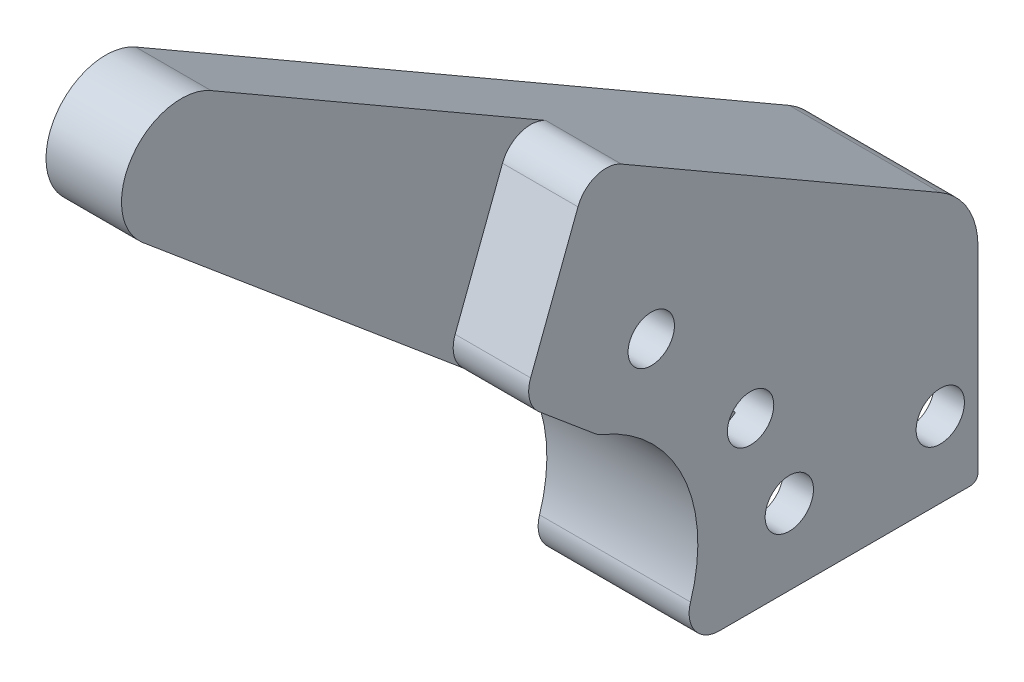
ISO-10303-21;
HEADER;
FILE_DESCRIPTION(('STEP AP214'),'2;1');
FILE_NAME('part.step','',(''),(''),'','','');
FILE_SCHEMA(('AUTOMOTIVE_DESIGN { 1 0 10303 214 1 1 1 1 }'));
ENDSEC;
DATA;
#1=APPLICATION_CONTEXT('core data for automotive mechanical design processes');
#2=APPLICATION_PROTOCOL_DEFINITION('international standard','automotive_design',2000,#1);
#3=PRODUCT_CONTEXT('',#1,'mechanical');
#4=PRODUCT('Part','Part','',(#3));
#5=PRODUCT_RELATED_PRODUCT_CATEGORY('part','',(#4));
#6=PRODUCT_DEFINITION_FORMATION('','',#4);
#7=PRODUCT_DEFINITION_CONTEXT('part definition',#1,'design');
#8=PRODUCT_DEFINITION('design','',#6,#7);
#9=PRODUCT_DEFINITION_SHAPE('','',#8);
#10=(LENGTH_UNIT() NAMED_UNIT(*) SI_UNIT(.MILLI.,.METRE.));
#11=(NAMED_UNIT(*) PLANE_ANGLE_UNIT() SI_UNIT($,.RADIAN.));
#12=(NAMED_UNIT(*) SI_UNIT($,.STERADIAN.) SOLID_ANGLE_UNIT());
#13=UNCERTAINTY_MEASURE_WITH_UNIT(LENGTH_MEASURE(1.E-05),#10,'distance_accuracy_value','');
#14=(GEOMETRIC_REPRESENTATION_CONTEXT(3) GLOBAL_UNCERTAINTY_ASSIGNED_CONTEXT((#13)) GLOBAL_UNIT_ASSIGNED_CONTEXT((#10,
#11,#12)) REPRESENTATION_CONTEXT('',''));
#15=CARTESIAN_POINT('',(0.,0.,0.));
#16=DIRECTION('',(0.,0.,1.));
#17=DIRECTION('',(1.,0.,0.));
#18=AXIS2_PLACEMENT_3D('',#15,#16,#17);
#19=CARTESIAN_POINT('',(2.54,23.8572726280624,-13.774002773942));
#20=DIRECTION('',(0.,-0.86602540378444,0.499999999999998));
#21=DIRECTION('',(0.,-0.499999999999998,-0.86602540378444));
#22=AXIS2_PLACEMENT_3D('',#19,#20,#21);
#23=PLANE('',#22);
#24=DIRECTION('',(0.,0.499999999999998,0.86602540378444));
#25=VECTOR('',#24,1.);
#26=CARTESIAN_POINT('',(-3.81,23.8572726280624,-13.774002773942));
#27=LINE('',#26,#25);
#28=CARTESIAN_POINT('',(-3.81,38.1368933066942,10.9590257542596));
#29=VERTEX_POINT('',#28);
#30=CARTESIAN_POINT('',(-3.81,54.394261314031,39.117613140312));
#31=VERTEX_POINT('',#30);
#32=EDGE_CURVE('E382',#29,#31,#27,.T.);
#33=ORIENTED_EDGE('',*,*,#32,.F.);
#34=DIRECTION('',(1.,0.,0.));
#35=VECTOR('',#34,1.);
#36=CARTESIAN_POINT('',(2.54,38.1368933066942,10.9590257542596));
#37=LINE('',#36,#35);
#38=CARTESIAN_POINT('',(2.54,38.1368933066942,10.9590257542596));
#39=VERTEX_POINT('',#38);
#40=EDGE_CURVE('E278',#29,#39,#37,.T.);
#41=ORIENTED_EDGE('',*,*,#40,.T.);
#42=DIRECTION('',(0.,0.499999999999998,0.86602540378444));
#43=VECTOR('',#42,1.);
#44=CARTESIAN_POINT('',(2.54,23.8572726280624,-13.774002773942));
#45=LINE('',#44,#43);
#46=CARTESIAN_POINT('',(2.54,22.6442613140312,-15.875));
#47=VERTEX_POINT('',#46);
#48=EDGE_CURVE('E231',#47,#39,#45,.T.);
#49=ORIENTED_EDGE('',*,*,#48,.F.);
#50=DIRECTION('',(-1.,0.,0.));
#51=VECTOR('',#50,1.);
#52=CARTESIAN_POINT('',(2.54,22.6442613140312,-15.875));
#53=LINE('',#52,#51);
#54=CARTESIAN_POINT('',(-10.16,22.6442613140312,-15.875));
#55=VERTEX_POINT('',#54);
#56=EDGE_CURVE('E254',#47,#55,#53,.T.);
#57=ORIENTED_EDGE('',*,*,#56,.T.);
#58=DIRECTION('',(0.,-0.499999999999998,-0.86602540378444));
#59=VECTOR('',#58,1.);
#60=CARTESIAN_POINT('',(-10.16,54.3942613140311,39.117613140312));
#61=LINE('',#60,#59);
#62=CARTESIAN_POINT('',(-10.16,54.394261314031,39.117613140312));
#63=VERTEX_POINT('',#62);
#64=EDGE_CURVE('E356',#63,#55,#61,.T.);
#65=ORIENTED_EDGE('',*,*,#64,.F.);
#66=DIRECTION('',(-1.,0.,0.));
#67=VECTOR('',#66,1.);
#68=CARTESIAN_POINT('',(2.54,54.3942613140311,39.117613140312));
#69=LINE('',#68,#67);
#70=EDGE_CURVE('E252',#31,#63,#69,.T.);
#71=ORIENTED_EDGE('',*,*,#70,.F.);
#72=EDGE_LOOP('',(#33,#41,#49,#57,#65,#71));
#73=FACE_BOUND('',#72,.T.);
#74=ADVANCED_FACE('F38',(#73),#23,.F.);
#75=CARTESIAN_POINT('',(2.54,50.0412000371606,41.6308542403118));
#76=DIRECTION('',(-1.,0.,0.));
#77=DIRECTION('',(0.,0.,1.));
#78=AXIS2_PLACEMENT_3D('',#75,#76,#77);
#79=CYLINDRICAL_SURFACE('',#78,5.02648220000002);
#80=DIRECTION('',(-1.,0.,0.));
#81=VECTOR('',#80,1.);
#82=CARTESIAN_POINT('',(2.54,46.1906912794143,44.8618147187819));
#83=LINE('',#82,#81);
#84=CARTESIAN_POINT('',(-3.81,46.1906912794143,44.8618147187819));
#85=VERTEX_POINT('',#84);
#86=CARTESIAN_POINT('',(-10.16,46.1906912794142,44.8618147187819));
#87=VERTEX_POINT('',#86);
#88=EDGE_CURVE('E242',#85,#87,#83,.T.);
#89=ORIENTED_EDGE('',*,*,#88,.F.);
#90=CARTESIAN_POINT('',(-3.81,50.0412000371606,41.6308542403118));
#91=DIRECTION('',(1.,0.,0.));
#92=DIRECTION('',(0.,0.,-1.));
#93=AXIS2_PLACEMENT_3D('',#90,#91,#92);
#94=CIRCLE('',#93,5.02648220000002);
#95=EDGE_CURVE('E380',#31,#85,#94,.T.);
#96=ORIENTED_EDGE('',*,*,#95,.F.);
#97=ORIENTED_EDGE('',*,*,#70,.T.);
#98=CARTESIAN_POINT('',(-10.16,50.0412000371606,41.6308542403118));
#99=DIRECTION('',(-1.,0.,0.));
#100=DIRECTION('',(0.,0.,1.));
#101=AXIS2_PLACEMENT_3D('',#98,#99,#100);
#102=CIRCLE('',#101,5.02648220000006);
#103=EDGE_CURVE('E359',#87,#63,#102,.T.);
#104=ORIENTED_EDGE('',*,*,#103,.F.);
#105=EDGE_LOOP('',(#89,#96,#97,#104));
#106=FACE_BOUND('',#105,.T.);
#107=ADVANCED_FACE('F467',(#106),#79,.T.);
#108=CARTESIAN_POINT('',(2.54,5.01567884800349,-4.20865427146339));
#109=DIRECTION('',(0.,-0.766044443118979,0.642787609686538));
#110=DIRECTION('',(0.,-0.642787609686538,-0.766044443118979));
#111=AXIS2_PLACEMENT_3D('',#108,#109,#110);
#112=PLANE('',#111);
#113=DIRECTION('',(0.,0.642787609686538,0.766044443118979));
#114=VECTOR('',#113,1.);
#115=CARTESIAN_POINT('',(2.54,5.01567884800349,-4.20865427146339));
#116=LINE('',#115,#114);
#117=CARTESIAN_POINT('',(2.54,19.6256972120867,13.2028876018002));
#118=VERTEX_POINT('',#117);
#119=CARTESIAN_POINT('',(2.54,23.521309949758,17.8454980772758));
#120=VERTEX_POINT('',#119);
#121=EDGE_CURVE('E234',#118,#120,#116,.T.);
#122=ORIENTED_EDGE('',*,*,#121,.T.);
#123=DIRECTION('',(1.,0.,0.));
#124=VECTOR('',#123,1.);
#125=CARTESIAN_POINT('',(2.54,23.521309949758,17.8454980772758));
#126=LINE('',#125,#124);
#127=CARTESIAN_POINT('',(-3.81,23.521309949758,17.8454980772758));
#128=VERTEX_POINT('',#127);
#129=EDGE_CURVE('E288',#120,#128,#126,.F.);
#130=ORIENTED_EDGE('',*,*,#129,.T.);
#131=DIRECTION('',(0.,-0.642787609686538,-0.766044443118979));
#132=VECTOR('',#131,1.);
#133=CARTESIAN_POINT('',(-3.81,5.01567884800349,-4.20865427146339));
#134=LINE('',#133,#132);
#135=EDGE_CURVE('E372',#85,#128,#134,.T.);
#136=ORIENTED_EDGE('',*,*,#135,.F.);
#137=ORIENTED_EDGE('',*,*,#88,.T.);
#138=DIRECTION('',(0.,0.642787609686536,0.76604444311898));
#139=VECTOR('',#138,1.);
#140=CARTESIAN_POINT('',(-10.16,19.3612947125966,12.887784973142));
#141=LINE('',#140,#139);
#142=CARTESIAN_POINT('',(-10.16,19.6256972120867,13.2028876018002));
#143=VERTEX_POINT('',#142);
#144=EDGE_CURVE('E343',#143,#87,#141,.T.);
#145=ORIENTED_EDGE('',*,*,#144,.F.);
#146=DIRECTION('',(-1.,0.,0.));
#147=VECTOR('',#146,1.);
#148=CARTESIAN_POINT('',(2.54,19.6256972120867,13.2028876018002));
#149=LINE('',#148,#147);
#150=EDGE_CURVE('E286',#143,#118,#149,.F.);
#151=ORIENTED_EDGE('',*,*,#150,.T.);
#152=EDGE_LOOP('',(#122,#130,#136,#137,#145,#151));
#153=FACE_BOUND('',#152,.T.);
#154=ADVANCED_FACE('F414',(#153),#112,.T.);
#155=CARTESIAN_POINT('',(2.54,0.,0.));
#156=DIRECTION('',(1.,0.,0.));
#157=DIRECTION('',(0.,0.,-1.));
#158=AXIS2_PLACEMENT_3D('',#155,#156,#157);
#159=PLANE('',#158);
#160=CARTESIAN_POINT('',(2.54,24.1395379058303,8.43878050170823));
#161=DIRECTION('',(1.,0.,0.));
#162=DIRECTION('',(0.,0.,-1.));
#163=AXIS2_PLACEMENT_3D('',#160,#161,#162);
#164=CIRCLE('',#163,1.95);
#165=CARTESIAN_POINT('',(2.54,24.1395379058303,6.48878050170823));
#166=VERTEX_POINT('',#165);
#167=EDGE_CURVE('E395',#166,#166,#164,.T.);
#168=ORIENTED_EDGE('',*,*,#167,.F.);
#169=EDGE_LOOP('',(#168));
#170=FACE_BOUND('',#169,.T.);
#171=CARTESIAN_POINT('',(2.54,14.1809601452836,0.0825415757831696));
#172=DIRECTION('',(1.,0.,0.));
#173=DIRECTION('',(0.,0.,-1.));
#174=AXIS2_PLACEMENT_3D('',#171,#172,#173);
#175=CIRCLE('',#174,1.95);
#176=CARTESIAN_POINT('',(2.54,14.1809601452836,-1.86745842421683));
#177=VERTEX_POINT('',#176);
#178=EDGE_CURVE('E389',#177,#177,#175,.T.);
#179=ORIENTED_EDGE('',*,*,#178,.F.);
#180=EDGE_LOOP('',(#179));
#181=FACE_BOUND('',#180,.T.);
#182=CARTESIAN_POINT('',(2.54,6.35,-15.875));
#183=DIRECTION('',(1.,0.,0.));
#184=DIRECTION('',(0.,0.,-1.));
#185=AXIS2_PLACEMENT_3D('',#182,#183,#184);
#186=CIRCLE('',#185,2.032);
#187=CARTESIAN_POINT('',(2.54,6.35,-17.907));
#188=VERTEX_POINT('',#187);
#189=EDGE_CURVE('E237',#188,#188,#186,.T.);
#190=ORIENTED_EDGE('',*,*,#189,.F.);
#191=EDGE_LOOP('',(#190));
#192=FACE_BOUND('',#191,.T.);
#193=CARTESIAN_POINT('',(2.54,6.35,-3.175));
#194=DIRECTION('',(1.,0.,0.));
#195=DIRECTION('',(0.,0.,-1.));
#196=AXIS2_PLACEMENT_3D('',#193,#194,#195);
#197=CIRCLE('',#196,2.032);
#198=CARTESIAN_POINT('',(2.54,6.35,-5.207));
#199=VERTEX_POINT('',#198);
#200=EDGE_CURVE('E240',#199,#199,#197,.T.);
#201=ORIENTED_EDGE('',*,*,#200,.F.);
#202=EDGE_LOOP('',(#201));
#203=FACE_BOUND('',#202,.T.);
#204=DIRECTION('',(0.,0.,-1.));
#205=VECTOR('',#204,1.);
#206=CARTESIAN_POINT('',(2.54,0.,0.));
#207=LINE('',#206,#205);
#208=CARTESIAN_POINT('',(2.54,0.,2.71177962288637));
#209=VERTEX_POINT('',#208);
#210=CARTESIAN_POINT('',(2.54,0.,-18.415));
#211=VERTEX_POINT('',#210);
#212=EDGE_CURVE('E222',#209,#211,#207,.T.);
#213=ORIENTED_EDGE('',*,*,#212,.T.);
#214=CARTESIAN_POINT('',(2.54,0.635000000000007,-18.415));
#215=DIRECTION('',(1.,0.,0.));
#216=DIRECTION('',(0.,0.,-1.));
#217=AXIS2_PLACEMENT_3D('',#214,#215,#216);
#218=CIRCLE('',#217,0.635);
#219=CARTESIAN_POINT('',(2.54,0.635000000000008,-19.05));
#220=VERTEX_POINT('',#219);
#221=EDGE_CURVE('E320',#211,#220,#218,.T.);
#222=ORIENTED_EDGE('',*,*,#221,.T.);
#223=DIRECTION('',(0.,1.,0.));
#224=VECTOR('',#223,1.);
#225=CARTESIAN_POINT('',(2.54,0.,-19.05));
#226=LINE('',#225,#224);
#227=CARTESIAN_POINT('',(2.54,17.145,-19.05));
#228=VERTEX_POINT('',#227);
#229=EDGE_CURVE('E226',#220,#228,#226,.T.);
#230=ORIENTED_EDGE('',*,*,#229,.T.);
#231=CARTESIAN_POINT('',(2.54,17.145,-12.7));
#232=DIRECTION('',(1.,0.,0.));
#233=DIRECTION('',(0.,0.,-1.));
#234=AXIS2_PLACEMENT_3D('',#231,#232,#233);
#235=CIRCLE('',#234,6.35);
#236=EDGE_CURVE('E228',#47,#228,#235,.F.);
#237=ORIENTED_EDGE('',*,*,#236,.F.);
#238=ORIENTED_EDGE('',*,*,#48,.T.);
#239=CARTESIAN_POINT('',(2.54,35.9371887810818,12.2290257542596));
#240=DIRECTION('',(1.,0.,0.));
#241=DIRECTION('',(0.,0.,-1.));
#242=AXIS2_PLACEMENT_3D('',#239,#240,#241);
#243=CIRCLE('',#242,2.54);
#244=CARTESIAN_POINT('',(2.54,36.8404609635108,14.6029885518725));
#245=VERTEX_POINT('',#244);
#246=EDGE_CURVE('E274',#39,#245,#243,.T.);
#247=ORIENTED_EDGE('',*,*,#246,.T.);
#248=DIRECTION('',(0.,-0.934631022682238,0.355618969460227));
#249=VECTOR('',#248,1.);
#250=CARTESIAN_POINT('',(2.54,9.51265554348265,25.0009806634441));
#251=LINE('',#250,#249);
#252=CARTESIAN_POINT('',(2.54,26.3703350177092,18.5867803462849));
#253=VERTEX_POINT('',#252);
#254=EDGE_CURVE('E375',#245,#253,#251,.T.);
#255=ORIENTED_EDGE('',*,*,#254,.T.);
#256=CARTESIAN_POINT('',(2.54,25.4670628352802,16.212817548672));
#257=DIRECTION('',(1.,0.,0.));
#258=DIRECTION('',(0.,0.,-1.));
#259=AXIS2_PLACEMENT_3D('',#256,#257,#258);
#260=CIRCLE('',#259,2.54);
#261=EDGE_CURVE('E272',#253,#120,#260,.T.);
#262=ORIENTED_EDGE('',*,*,#261,.T.);
#263=ORIENTED_EDGE('',*,*,#121,.F.);
#264=CARTESIAN_POINT('',(2.54,21.5714500976089,11.5702070731964));
#265=DIRECTION('',(1.,0.,0.));
#266=DIRECTION('',(0.,0.,-1.));
#267=AXIS2_PLACEMENT_3D('',#264,#265,#266);
#268=CIRCLE('',#267,2.54);
#269=CARTESIAN_POINT('',(2.54,19.2230512375488,12.5379998165399));
#270=VERTEX_POINT('',#269);
#271=EDGE_CURVE('E270',#118,#270,#268,.T.);
#272=ORIENTED_EDGE('',*,*,#271,.T.);
#273=CARTESIAN_POINT('',(2.54,7.24621705124219,17.4737428075918));
#274=DIRECTION('',(1.,0.,0.));
#275=DIRECTION('',(0.,0.,-1.));
#276=AXIS2_PLACEMENT_3D('',#273,#274,#275);
#277=CIRCLE('',#276,12.954);
#278=CARTESIAN_POINT('',(2.54,3.31151099200692,5.13177358759218));
#279=VERTEX_POINT('',#278);
#280=EDGE_CURVE('E219',#279,#270,#277,.T.);
#281=ORIENTED_EDGE('',*,*,#280,.F.);
#282=CARTESIAN_POINT('',(2.54,2.54,2.71177962288637));
#283=DIRECTION('',(1.,0.,0.));
#284=DIRECTION('',(0.,0.,-1.));
#285=AXIS2_PLACEMENT_3D('',#282,#283,#284);
#286=CIRCLE('',#285,2.54);
#287=EDGE_CURVE('E276',#279,#209,#286,.T.);
#288=ORIENTED_EDGE('',*,*,#287,.T.);
#289=EDGE_LOOP('',(#213,#222,#230,#237,#238,#247,#255,#262,#263,#272,#281,#288));
#290=FACE_BOUND('',#289,.T.);
#291=ADVANCED_FACE('F410',(#170,#181,#192,#203,#290),#159,.T.);
#292=CARTESIAN_POINT('',(2.54,7.24621705124219,17.4737428075918));
#293=DIRECTION('',(-1.,0.,0.));
#294=DIRECTION('',(0.,0.,1.));
#295=AXIS2_PLACEMENT_3D('',#292,#293,#294);
#296=CYLINDRICAL_SURFACE('',#295,12.954);
#297=CARTESIAN_POINT('',(-10.16,7.24621705124219,17.4737428075918));
#298=DIRECTION('',(1.,0.,0.));
#299=DIRECTION('',(0.,0.,1.));
#300=AXIS2_PLACEMENT_3D('',#297,#298,#299);
#301=CIRCLE('',#300,12.954);
#302=CARTESIAN_POINT('',(-10.16,3.31151099200692,5.13177358759218));
#303=VERTEX_POINT('',#302);
#304=CARTESIAN_POINT('',(-10.16,19.2230512375488,12.5379998165399));
#305=VERTEX_POINT('',#304);
#306=EDGE_CURVE('E340',#303,#305,#301,.T.);
#307=ORIENTED_EDGE('',*,*,#306,.F.);
#308=DIRECTION('',(-1.,0.,0.));
#309=VECTOR('',#308,1.);
#310=CARTESIAN_POINT('',(2.54,3.31151099200692,5.13177358759218));
#311=LINE('',#310,#309);
#312=EDGE_CURVE('E268',#303,#279,#311,.F.);
#313=ORIENTED_EDGE('',*,*,#312,.T.);
#314=ORIENTED_EDGE('',*,*,#280,.T.);
#315=DIRECTION('',(-1.,0.,0.));
#316=VECTOR('',#315,1.);
#317=CARTESIAN_POINT('',(2.54,19.2230512375488,12.5379998165399));
#318=LINE('',#317,#316);
#319=EDGE_CURVE('E265',#270,#305,#318,.T.);
#320=ORIENTED_EDGE('',*,*,#319,.T.);
#321=EDGE_LOOP('',(#307,#313,#314,#320));
#322=FACE_BOUND('',#321,.T.);
#323=ADVANCED_FACE('F413',(#322),#296,.F.);
#324=CARTESIAN_POINT('',(2.54,0.,0.));
#325=DIRECTION('',(0.,1.,0.));
#326=DIRECTION('',(0.,0.,1.));
#327=AXIS2_PLACEMENT_3D('',#324,#325,#326);
#328=PLANE('',#327);
#329=DIRECTION('',(0.,0.,1.));
#330=VECTOR('',#329,1.);
#331=CARTESIAN_POINT('',(-10.16,0.,-19.05));
#332=LINE('',#331,#330);
#333=CARTESIAN_POINT('',(-10.16,0.,-18.415));
#334=VERTEX_POINT('',#333);
#335=CARTESIAN_POINT('',(-10.16,0.,2.71177962288637));
#336=VERTEX_POINT('',#335);
#337=EDGE_CURVE('E217',#334,#336,#332,.T.);
#338=ORIENTED_EDGE('',*,*,#337,.F.);
#339=DIRECTION('',(1.,0.,0.));
#340=VECTOR('',#339,1.);
#341=CARTESIAN_POINT('',(2.54,0.,-18.415));
#342=LINE('',#341,#340);
#343=CARTESIAN_POINT('',(-7.62,0.,-18.415));
#344=VERTEX_POINT('',#343);
#345=EDGE_CURVE('E311',#334,#344,#342,.T.);
#346=ORIENTED_EDGE('',*,*,#345,.T.);
#347=DIRECTION('',(0.,0.,1.));
#348=VECTOR('',#347,1.);
#349=CARTESIAN_POINT('',(-7.62,0.,-19.05));
#350=LINE('',#349,#348);
#351=CARTESIAN_POINT('',(-7.62,0.,0.635));
#352=VERTEX_POINT('',#351);
#353=EDGE_CURVE('E332',#344,#352,#350,.T.);
#354=ORIENTED_EDGE('',*,*,#353,.T.);
#355=DIRECTION('',(1.,0.,0.));
#356=VECTOR('',#355,1.);
#357=CARTESIAN_POINT('',(0.,0.,0.635));
#358=LINE('',#357,#356);
#359=CARTESIAN_POINT('',(0.,0.,0.635));
#360=VERTEX_POINT('',#359);
#361=EDGE_CURVE('E306',#352,#360,#358,.T.);
#362=ORIENTED_EDGE('',*,*,#361,.T.);
#363=DIRECTION('',(0.,0.,-1.));
#364=VECTOR('',#363,1.);
#365=CARTESIAN_POINT('',(0.,0.,0.));
#366=LINE('',#365,#364);
#367=CARTESIAN_POINT('',(0.,0.,-18.415));
#368=VERTEX_POINT('',#367);
#369=EDGE_CURVE('E206',#360,#368,#366,.T.);
#370=ORIENTED_EDGE('',*,*,#369,.T.);
#371=DIRECTION('',(-1.,0.,0.));
#372=VECTOR('',#371,1.);
#373=CARTESIAN_POINT('',(2.54,0.,-18.415));
#374=LINE('',#373,#372);
#375=EDGE_CURVE('E309',#368,#211,#374,.F.);
#376=ORIENTED_EDGE('',*,*,#375,.T.);
#377=ORIENTED_EDGE('',*,*,#212,.F.);
#378=DIRECTION('',(1.,0.,0.));
#379=VECTOR('',#378,1.);
#380=CARTESIAN_POINT('',(-10.16,0.,2.71177962288637));
#381=LINE('',#380,#379);
#382=EDGE_CURVE('E258',#209,#336,#381,.F.);
#383=ORIENTED_EDGE('',*,*,#382,.T.);
#384=EDGE_LOOP('',(#338,#346,#354,#362,#370,#376,#377,#383));
#385=FACE_BOUND('',#384,.T.);
#386=ADVANCED_FACE('F337',(#385),#328,.F.);
#387=CARTESIAN_POINT('',(2.54,0.,-19.05));
#388=DIRECTION('',(0.,0.,1.));
#389=DIRECTION('',(0.,-1.,0.));
#390=AXIS2_PLACEMENT_3D('',#387,#388,#389);
#391=PLANE('',#390);
#392=DIRECTION('',(0.,1.,0.));
#393=VECTOR('',#392,1.);
#394=CARTESIAN_POINT('',(0.,0.,-19.05));
#395=LINE('',#394,#393);
#396=CARTESIAN_POINT('',(0.,0.635000000000008,-19.05));
#397=VERTEX_POINT('',#396);
#398=CARTESIAN_POINT('',(0.,13.335,-19.05));
#399=VERTEX_POINT('',#398);
#400=EDGE_CURVE('E210',#397,#399,#395,.T.);
#401=ORIENTED_EDGE('',*,*,#400,.T.);
#402=DIRECTION('',(1.,0.,0.));
#403=VECTOR('',#402,1.);
#404=CARTESIAN_POINT('',(-7.62,13.335,-19.05));
#405=LINE('',#404,#403);
#406=CARTESIAN_POINT('',(-7.62,13.335,-19.05));
#407=VERTEX_POINT('',#406);
#408=EDGE_CURVE('E303',#399,#407,#405,.F.);
#409=ORIENTED_EDGE('',*,*,#408,.T.);
#410=DIRECTION('',(0.,-1.,0.));
#411=VECTOR('',#410,1.);
#412=CARTESIAN_POINT('',(-7.62,17.145,-19.05));
#413=LINE('',#412,#411);
#414=CARTESIAN_POINT('',(-7.62,0.635000000000007,-19.05));
#415=VERTEX_POINT('',#414);
#416=EDGE_CURVE('E341',#407,#415,#413,.T.);
#417=ORIENTED_EDGE('',*,*,#416,.T.);
#418=DIRECTION('',(1.,0.,0.));
#419=VECTOR('',#418,1.);
#420=CARTESIAN_POINT('',(2.54,0.635000000000008,-19.05));
#421=LINE('',#420,#419);
#422=CARTESIAN_POINT('',(-10.16,0.635000000000007,-19.05));
#423=VERTEX_POINT('',#422);
#424=EDGE_CURVE('E301',#415,#423,#421,.F.);
#425=ORIENTED_EDGE('',*,*,#424,.T.);
#426=DIRECTION('',(0.,-1.,0.));
#427=VECTOR('',#426,1.);
#428=CARTESIAN_POINT('',(-10.16,17.145,-19.05));
#429=LINE('',#428,#427);
#430=CARTESIAN_POINT('',(-10.16,17.145,-19.05));
#431=VERTEX_POINT('',#430);
#432=EDGE_CURVE('E350',#431,#423,#429,.T.);
#433=ORIENTED_EDGE('',*,*,#432,.F.);
#434=DIRECTION('',(-1.,0.,0.));
#435=VECTOR('',#434,1.);
#436=CARTESIAN_POINT('',(2.54,17.145,-19.05));
#437=LINE('',#436,#435);
#438=EDGE_CURVE('E256',#228,#431,#437,.T.);
#439=ORIENTED_EDGE('',*,*,#438,.F.);
#440=ORIENTED_EDGE('',*,*,#229,.F.);
#441=DIRECTION('',(-1.,0.,0.));
#442=VECTOR('',#441,1.);
#443=CARTESIAN_POINT('',(2.54,0.635000000000008,-19.05));
#444=LINE('',#443,#442);
#445=EDGE_CURVE('E298',#220,#397,#444,.T.);
#446=ORIENTED_EDGE('',*,*,#445,.T.);
#447=EDGE_LOOP('',(#401,#409,#417,#425,#433,#439,#440,#446));
#448=FACE_BOUND('',#447,.T.);
#449=ADVANCED_FACE('F433',(#448),#391,.F.);
#450=CARTESIAN_POINT('',(2.54,17.145,-12.7));
#451=DIRECTION('',(-1.,0.,0.));
#452=DIRECTION('',(0.,0.,1.));
#453=AXIS2_PLACEMENT_3D('',#450,#451,#452);
#454=CYLINDRICAL_SURFACE('',#453,6.35);
#455=ORIENTED_EDGE('',*,*,#438,.T.);
#456=CARTESIAN_POINT('',(-10.16,17.145,-12.7));
#457=DIRECTION('',(-1.,0.,0.));
#458=DIRECTION('',(0.,0.,1.));
#459=AXIS2_PLACEMENT_3D('',#456,#457,#458);
#460=CIRCLE('',#459,6.34999999999999);
#461=EDGE_CURVE('E353',#55,#431,#460,.T.);
#462=ORIENTED_EDGE('',*,*,#461,.F.);
#463=ORIENTED_EDGE('',*,*,#56,.F.);
#464=ORIENTED_EDGE('',*,*,#236,.T.);
#465=EDGE_LOOP('',(#455,#462,#463,#464));
#466=FACE_BOUND('',#465,.T.);
#467=ADVANCED_FACE('F475',(#466),#454,.T.);
#468=CARTESIAN_POINT('',(2.54,6.35,-15.875));
#469=DIRECTION('',(-1.,0.,0.));
#470=DIRECTION('',(0.,0.,1.));
#471=AXIS2_PLACEMENT_3D('',#468,#469,#470);
#472=CYLINDRICAL_SURFACE('',#471,2.032);
#473=ORIENTED_EDGE('',*,*,#189,.T.);
#474=EDGE_LOOP('',(#473));
#475=FACE_BOUND('',#474,.T.);
#476=CARTESIAN_POINT('',(0.,6.35,-15.875));
#477=DIRECTION('',(1.,0.,0.));
#478=DIRECTION('',(0.,0.,-1.));
#479=AXIS2_PLACEMENT_3D('',#476,#477,#478);
#480=CIRCLE('',#479,2.032);
#481=CARTESIAN_POINT('',(0.,6.35,-17.907));
#482=VERTEX_POINT('',#481);
#483=EDGE_CURVE('E245',#482,#482,#480,.T.);
#484=ORIENTED_EDGE('',*,*,#483,.F.);
#485=EDGE_LOOP('',(#484));
#486=FACE_BOUND('',#485,.T.);
#487=ADVANCED_FACE('F510',(#475,#486),#472,.F.);
#488=CARTESIAN_POINT('',(2.54,6.35,-3.175));
#489=DIRECTION('',(-1.,0.,0.));
#490=DIRECTION('',(0.,0.,1.));
#491=AXIS2_PLACEMENT_3D('',#488,#489,#490);
#492=CYLINDRICAL_SURFACE('',#491,2.032);
#493=ORIENTED_EDGE('',*,*,#200,.T.);
#494=EDGE_LOOP('',(#493));
#495=FACE_BOUND('',#494,.T.);
#496=CARTESIAN_POINT('',(0.,6.35,-3.175));
#497=DIRECTION('',(1.,0.,0.));
#498=DIRECTION('',(0.,0.,-1.));
#499=AXIS2_PLACEMENT_3D('',#496,#497,#498);
#500=CIRCLE('',#499,2.032);
#501=CARTESIAN_POINT('',(0.,6.35,-5.207));
#502=VERTEX_POINT('',#501);
#503=EDGE_CURVE('E223',#502,#502,#500,.T.);
#504=ORIENTED_EDGE('',*,*,#503,.F.);
#505=EDGE_LOOP('',(#504));
#506=FACE_BOUND('',#505,.T.);
#507=ADVANCED_FACE('F548',(#495,#506),#492,.F.);
#508=CARTESIAN_POINT('',(0.,0.,0.));
#509=DIRECTION('',(1.,0.,0.));
#510=DIRECTION('',(0.,0.,-1.));
#511=AXIS2_PLACEMENT_3D('',#508,#509,#510);
#512=PLANE('',#511);
#513=DIRECTION('',(0.,1.,0.));
#514=VECTOR('',#513,1.);
#515=CARTESIAN_POINT('',(0.,0.,0.));
#516=LINE('',#515,#514);
#517=CARTESIAN_POINT('',(0.,0.635,0.));
#518=VERTEX_POINT('',#517);
#519=CARTESIAN_POINT('',(0.,12.232707880235,0.));
#520=VERTEX_POINT('',#519);
#521=EDGE_CURVE('E215',#518,#520,#516,.T.);
#522=ORIENTED_EDGE('',*,*,#521,.T.);
#523=CARTESIAN_POINT('',(0.,14.1809601452836,0.0825415757831696));
#524=DIRECTION('',(1.,0.,0.));
#525=DIRECTION('',(0.,0.,-1.));
#526=AXIS2_PLACEMENT_3D('',#523,#524,#525);
#527=CIRCLE('',#526,1.95);
#528=CARTESIAN_POINT('',(0.,12.7,-1.18602338041006));
#529=VERTEX_POINT('',#528);
#530=EDGE_CURVE('E199',#520,#529,#527,.T.);
#531=ORIENTED_EDGE('',*,*,#530,.T.);
#532=DIRECTION('',(0.,0.,-1.));
#533=VECTOR('',#532,1.);
#534=CARTESIAN_POINT('',(0.,12.7,0.));
#535=LINE('',#534,#533);
#536=CARTESIAN_POINT('',(0.,12.7,-18.415));
#537=VERTEX_POINT('',#536);
#538=EDGE_CURVE('E198',#529,#537,#535,.T.);
#539=ORIENTED_EDGE('',*,*,#538,.T.);
#540=CARTESIAN_POINT('',(0.,13.335,-18.415));
#541=DIRECTION('',(1.,0.,0.));
#542=DIRECTION('',(0.,0.,-1.));
#543=AXIS2_PLACEMENT_3D('',#540,#541,#542);
#544=CIRCLE('',#543,0.635);
#545=EDGE_CURVE('E324',#537,#399,#544,.T.);
#546=ORIENTED_EDGE('',*,*,#545,.T.);
#547=ORIENTED_EDGE('',*,*,#400,.F.);
#548=CARTESIAN_POINT('',(0.,0.635000000000007,-18.415));
#549=DIRECTION('',(1.,0.,0.));
#550=DIRECTION('',(0.,0.,-1.));
#551=AXIS2_PLACEMENT_3D('',#548,#549,#550);
#552=CIRCLE('',#551,0.635);
#553=EDGE_CURVE('E318',#397,#368,#552,.F.);
#554=ORIENTED_EDGE('',*,*,#553,.T.);
#555=ORIENTED_EDGE('',*,*,#369,.F.);
#556=CARTESIAN_POINT('',(0.,0.635,0.635));
#557=DIRECTION('',(1.,0.,0.));
#558=DIRECTION('',(0.,0.,-1.));
#559=AXIS2_PLACEMENT_3D('',#556,#557,#558);
#560=CIRCLE('',#559,0.635);
#561=EDGE_CURVE('E60',#360,#518,#560,.T.);
#562=ORIENTED_EDGE('',*,*,#561,.T.);
#563=EDGE_LOOP('',(#522,#531,#539,#546,#547,#554,#555,#562));
#564=FACE_BOUND('',#563,.T.);
#565=ORIENTED_EDGE('',*,*,#483,.T.);
#566=EDGE_LOOP('',(#565));
#567=FACE_BOUND('',#566,.T.);
#568=ORIENTED_EDGE('',*,*,#503,.T.);
#569=EDGE_LOOP('',(#568));
#570=FACE_BOUND('',#569,.T.);
#571=ADVANCED_FACE('F435',(#564,#567,#570),#512,.F.);
#572=CARTESIAN_POINT('',(-7.62,12.7,0.));
#573=DIRECTION('',(0.,-1.,0.));
#574=DIRECTION('',(0.,0.,-1.));
#575=AXIS2_PLACEMENT_3D('',#572,#573,#574);
#576=PLANE('',#575);
#577=DIRECTION('',(1.,0.,0.));
#578=VECTOR('',#577,1.);
#579=CARTESIAN_POINT('',(-10.16,12.7,-1.18602338041006));
#580=LINE('',#579,#578);
#581=CARTESIAN_POINT('',(-7.62,12.7,-1.18602338041006));
#582=VERTEX_POINT('',#581);
#583=EDGE_CURVE('E186',#582,#529,#580,.T.);
#584=ORIENTED_EDGE('',*,*,#583,.F.);
#585=DIRECTION('',(0.,0.,-1.));
#586=VECTOR('',#585,1.);
#587=CARTESIAN_POINT('',(-7.62,12.7,0.));
#588=LINE('',#587,#586);
#589=CARTESIAN_POINT('',(-7.62,12.7,-18.415));
#590=VERTEX_POINT('',#589);
#591=EDGE_CURVE('E196',#582,#590,#588,.T.);
#592=ORIENTED_EDGE('',*,*,#591,.T.);
#593=DIRECTION('',(1.,0.,0.));
#594=VECTOR('',#593,1.);
#595=CARTESIAN_POINT('',(0.,12.7,-18.415));
#596=LINE('',#595,#594);
#597=EDGE_CURVE('E296',#590,#537,#596,.T.);
#598=ORIENTED_EDGE('',*,*,#597,.T.);
#599=ORIENTED_EDGE('',*,*,#538,.F.);
#600=EDGE_LOOP('',(#584,#592,#598,#599));
#601=FACE_BOUND('',#600,.T.);
#602=ADVANCED_FACE('F194',(#601),#576,.T.);
#603=CARTESIAN_POINT('',(-7.62,0.,0.));
#604=DIRECTION('',(0.,0.,-1.));
#605=DIRECTION('',(0.,1.,0.));
#606=AXIS2_PLACEMENT_3D('',#603,#604,#605);
#607=PLANE('',#606);
#608=DIRECTION('',(1.,0.,0.));
#609=VECTOR('',#608,1.);
#610=CARTESIAN_POINT('',(-10.16,12.232707880235,0.));
#611=LINE('',#610,#609);
#612=CARTESIAN_POINT('',(-7.62,12.232707880235,0.));
#613=VERTEX_POINT('',#612);
#614=EDGE_CURVE('E53',#520,#613,#611,.F.);
#615=ORIENTED_EDGE('',*,*,#614,.F.);
#616=ORIENTED_EDGE('',*,*,#521,.F.);
#617=DIRECTION('',(1.,0.,0.));
#618=VECTOR('',#617,1.);
#619=CARTESIAN_POINT('',(-7.62,0.635,0.));
#620=LINE('',#619,#618);
#621=CARTESIAN_POINT('',(-7.62,0.635,0.));
#622=VERTEX_POINT('',#621);
#623=EDGE_CURVE('E322',#518,#622,#620,.F.);
#624=ORIENTED_EDGE('',*,*,#623,.T.);
#625=DIRECTION('',(0.,1.,0.));
#626=VECTOR('',#625,1.);
#627=CARTESIAN_POINT('',(-7.62,0.,0.));
#628=LINE('',#627,#626);
#629=EDGE_CURVE('E207',#622,#613,#628,.T.);
#630=ORIENTED_EDGE('',*,*,#629,.T.);
#631=EDGE_LOOP('',(#615,#616,#624,#630));
#632=FACE_BOUND('',#631,.T.);
#633=ADVANCED_FACE('F538',(#632),#607,.T.);
#634=CARTESIAN_POINT('',(-10.16,7.24621705124219,17.4737428075918));
#635=DIRECTION('',(-1.,0.,0.));
#636=DIRECTION('',(0.,0.,1.));
#637=AXIS2_PLACEMENT_3D('',#634,#635,#636);
#638=PLANE('',#637);
#639=CARTESIAN_POINT('',(-10.16,24.1395379058303,8.43878050170823));
#640=DIRECTION('',(1.,0.,0.));
#641=DIRECTION('',(0.,0.,-1.));
#642=AXIS2_PLACEMENT_3D('',#639,#640,#641);
#643=CIRCLE('',#642,1.95);
#644=CARTESIAN_POINT('',(-10.16,24.1395379058303,6.48878050170823));
#645=VERTEX_POINT('',#644);
#646=EDGE_CURVE('E388',#645,#645,#643,.T.);
#647=ORIENTED_EDGE('',*,*,#646,.T.);
#648=EDGE_LOOP('',(#647));
#649=FACE_BOUND('',#648,.T.);
#650=CARTESIAN_POINT('',(-10.16,14.1809601452836,0.0825415757831696));
#651=DIRECTION('',(1.,0.,0.));
#652=DIRECTION('',(0.,0.,-1.));
#653=AXIS2_PLACEMENT_3D('',#650,#651,#652);
#654=CIRCLE('',#653,1.95);
#655=CARTESIAN_POINT('',(-10.16,14.1809601452836,-1.86745842421683));
#656=VERTEX_POINT('',#655);
#657=EDGE_CURVE('E392',#656,#656,#654,.T.);
#658=ORIENTED_EDGE('',*,*,#657,.T.);
#659=EDGE_LOOP('',(#658));
#660=FACE_BOUND('',#659,.T.);
#661=CARTESIAN_POINT('',(-10.16,6.35,-3.175));
#662=DIRECTION('',(-1.,0.,0.));
#663=DIRECTION('',(0.,0.,1.));
#664=AXIS2_PLACEMENT_3D('',#661,#662,#663);
#665=CIRCLE('',#664,2.032);
#666=CARTESIAN_POINT('',(-10.16,6.35,-1.14300000000001));
#667=VERTEX_POINT('',#666);
#668=EDGE_CURVE('E346',#667,#667,#665,.T.);
#669=ORIENTED_EDGE('',*,*,#668,.F.);
#670=EDGE_LOOP('',(#669));
#671=FACE_BOUND('',#670,.T.);
#672=ORIENTED_EDGE('',*,*,#432,.T.);
#673=CARTESIAN_POINT('',(-10.16,0.635000000000007,-18.415));
#674=DIRECTION('',(-1.,0.,0.));
#675=DIRECTION('',(0.,0.,1.));
#676=AXIS2_PLACEMENT_3D('',#673,#674,#675);
#677=CIRCLE('',#676,0.635);
#678=EDGE_CURVE('E316',#423,#334,#677,.T.);
#679=ORIENTED_EDGE('',*,*,#678,.T.);
#680=ORIENTED_EDGE('',*,*,#337,.T.);
#681=CARTESIAN_POINT('',(-10.16,2.54,2.71177962288637));
#682=DIRECTION('',(-1.,0.,0.));
#683=DIRECTION('',(0.,0.,1.));
#684=AXIS2_PLACEMENT_3D('',#681,#682,#683);
#685=CIRCLE('',#684,2.54);
#686=EDGE_CURVE('E263',#336,#303,#685,.T.);
#687=ORIENTED_EDGE('',*,*,#686,.T.);
#688=ORIENTED_EDGE('',*,*,#306,.T.);
#689=CARTESIAN_POINT('',(-10.16,21.5714500976089,11.5702070731964));
#690=DIRECTION('',(-1.,0.,0.));
#691=DIRECTION('',(0.,0.,1.));
#692=AXIS2_PLACEMENT_3D('',#689,#690,#691);
#693=CIRCLE('',#692,2.54);
#694=EDGE_CURVE('E261',#305,#143,#693,.T.);
#695=ORIENTED_EDGE('',*,*,#694,.T.);
#696=ORIENTED_EDGE('',*,*,#144,.T.);
#697=ORIENTED_EDGE('',*,*,#103,.T.);
#698=ORIENTED_EDGE('',*,*,#64,.T.);
#699=ORIENTED_EDGE('',*,*,#461,.T.);
#700=EDGE_LOOP('',(#672,#679,#680,#687,#688,#695,#696,#697,#698,#699));
#701=FACE_BOUND('',#700,.T.);
#702=CARTESIAN_POINT('',(-10.16,6.35,-15.875));
#703=DIRECTION('',(-1.,0.,0.));
#704=DIRECTION('',(0.,0.,1.));
#705=AXIS2_PLACEMENT_3D('',#702,#703,#704);
#706=CIRCLE('',#705,2.032);
#707=CARTESIAN_POINT('',(-10.16,6.35,-13.843));
#708=VERTEX_POINT('',#707);
#709=EDGE_CURVE('E366',#708,#708,#706,.T.);
#710=ORIENTED_EDGE('',*,*,#709,.F.);
#711=EDGE_LOOP('',(#710));
#712=FACE_BOUND('',#711,.T.);
#713=ADVANCED_FACE('F401',(#649,#660,#671,#701,#712),#638,.T.);
#714=CARTESIAN_POINT('',(-7.62,7.24621705124219,17.4737428075918));
#715=DIRECTION('',(-1.,0.,0.));
#716=DIRECTION('',(0.,0.,1.));
#717=AXIS2_PLACEMENT_3D('',#714,#715,#716);
#718=PLANE('',#717);
#719=ORIENTED_EDGE('',*,*,#591,.F.);
#720=CARTESIAN_POINT('',(-7.62,14.1809601452836,0.0825415757831696));
#721=DIRECTION('',(-1.,0.,0.));
#722=DIRECTION('',(0.,0.,1.));
#723=AXIS2_PLACEMENT_3D('',#720,#721,#722);
#724=CIRCLE('',#723,1.95);
#725=EDGE_CURVE('E11',#582,#613,#724,.T.);
#726=ORIENTED_EDGE('',*,*,#725,.T.);
#727=ORIENTED_EDGE('',*,*,#629,.F.);
#728=CARTESIAN_POINT('',(-7.62,0.635,0.635));
#729=DIRECTION('',(-1.,0.,0.));
#730=DIRECTION('',(0.,0.,1.));
#731=AXIS2_PLACEMENT_3D('',#728,#729,#730);
#732=CIRCLE('',#731,0.635);
#733=EDGE_CURVE('E46',#622,#352,#732,.T.);
#734=ORIENTED_EDGE('',*,*,#733,.T.);
#735=ORIENTED_EDGE('',*,*,#353,.F.);
#736=CARTESIAN_POINT('',(-7.62,0.635000000000007,-18.415));
#737=DIRECTION('',(-1.,0.,0.));
#738=DIRECTION('',(0.,0.,1.));
#739=AXIS2_PLACEMENT_3D('',#736,#737,#738);
#740=CIRCLE('',#739,0.635);
#741=EDGE_CURVE('E314',#344,#415,#740,.F.);
#742=ORIENTED_EDGE('',*,*,#741,.T.);
#743=ORIENTED_EDGE('',*,*,#416,.F.);
#744=CARTESIAN_POINT('',(-7.62,13.335,-18.415));
#745=DIRECTION('',(-1.,0.,0.));
#746=DIRECTION('',(0.,0.,1.));
#747=AXIS2_PLACEMENT_3D('',#744,#745,#746);
#748=CIRCLE('',#747,0.635);
#749=EDGE_CURVE('E204',#407,#590,#748,.T.);
#750=ORIENTED_EDGE('',*,*,#749,.T.);
#751=EDGE_LOOP('',(#719,#726,#727,#734,#735,#742,#743,#750));
#752=FACE_BOUND('',#751,.T.);
#753=CARTESIAN_POINT('',(-7.62,6.35,-3.175));
#754=DIRECTION('',(-1.,0.,0.));
#755=DIRECTION('',(0.,0.,1.));
#756=AXIS2_PLACEMENT_3D('',#753,#754,#755);
#757=CIRCLE('',#756,2.032);
#758=CARTESIAN_POINT('',(-7.62,6.35,-1.14300000000001));
#759=VERTEX_POINT('',#758);
#760=EDGE_CURVE('E363',#759,#759,#757,.T.);
#761=ORIENTED_EDGE('',*,*,#760,.T.);
#762=EDGE_LOOP('',(#761));
#763=FACE_BOUND('',#762,.T.);
#764=CARTESIAN_POINT('',(-7.62,6.35,-15.875));
#765=DIRECTION('',(-1.,0.,0.));
#766=DIRECTION('',(0.,0.,1.));
#767=AXIS2_PLACEMENT_3D('',#764,#765,#766);
#768=CIRCLE('',#767,2.032);
#769=CARTESIAN_POINT('',(-7.62,6.35,-13.843));
#770=VERTEX_POINT('',#769);
#771=EDGE_CURVE('E369',#770,#770,#768,.T.);
#772=ORIENTED_EDGE('',*,*,#771,.T.);
#773=EDGE_LOOP('',(#772));
#774=FACE_BOUND('',#773,.T.);
#775=ADVANCED_FACE('F201',(#752,#763,#774),#718,.F.);
#776=CARTESIAN_POINT('',(-10.16,6.35,-3.175));
#777=DIRECTION('',(1.,0.,0.));
#778=DIRECTION('',(0.,0.,-1.));
#779=AXIS2_PLACEMENT_3D('',#776,#777,#778);
#780=CYLINDRICAL_SURFACE('',#779,2.032);
#781=ORIENTED_EDGE('',*,*,#668,.T.);
#782=EDGE_LOOP('',(#781));
#783=FACE_BOUND('',#782,.T.);
#784=ORIENTED_EDGE('',*,*,#760,.F.);
#785=EDGE_LOOP('',(#784));
#786=FACE_BOUND('',#785,.T.);
#787=ADVANCED_FACE('F531',(#783,#786),#780,.F.);
#788=CARTESIAN_POINT('',(-10.16,6.35,-15.875));
#789=DIRECTION('',(1.,0.,0.));
#790=DIRECTION('',(0.,0.,-1.));
#791=AXIS2_PLACEMENT_3D('',#788,#789,#790);
#792=CYLINDRICAL_SURFACE('',#791,2.032);
#793=ORIENTED_EDGE('',*,*,#709,.T.);
#794=EDGE_LOOP('',(#793));
#795=FACE_BOUND('',#794,.T.);
#796=ORIENTED_EDGE('',*,*,#771,.F.);
#797=EDGE_LOOP('',(#796));
#798=FACE_BOUND('',#797,.T.);
#799=ADVANCED_FACE('F525',(#795,#798),#792,.F.);
#800=CARTESIAN_POINT('',(-3.81,9.51265554348265,25.0009806634441));
#801=DIRECTION('',(0.,0.355618969460227,0.934631022682238));
#802=DIRECTION('',(0.,-0.934631022682238,0.355618969460227));
#803=AXIS2_PLACEMENT_3D('',#800,#801,#802);
#804=PLANE('',#803);
#805=ORIENTED_EDGE('',*,*,#254,.F.);
#806=DIRECTION('',(1.,0.,0.));
#807=VECTOR('',#806,1.);
#808=CARTESIAN_POINT('',(-3.81,36.8404609635107,14.6029885518725));
#809=LINE('',#808,#807);
#810=CARTESIAN_POINT('',(-3.81,36.8404609635108,14.6029885518725));
#811=VERTEX_POINT('',#810);
#812=EDGE_CURVE('E284',#245,#811,#809,.F.);
#813=ORIENTED_EDGE('',*,*,#812,.T.);
#814=DIRECTION('',(0.,-0.934631022682238,0.355618969460227));
#815=VECTOR('',#814,1.);
#816=CARTESIAN_POINT('',(-3.81,9.51265554348265,25.0009806634441));
#817=LINE('',#816,#815);
#818=CARTESIAN_POINT('',(-3.81,26.3703350177092,18.5867803462849));
#819=VERTEX_POINT('',#818);
#820=EDGE_CURVE('E378',#811,#819,#817,.T.);
#821=ORIENTED_EDGE('',*,*,#820,.T.);
#822=DIRECTION('',(1.,0.,0.));
#823=VECTOR('',#822,1.);
#824=CARTESIAN_POINT('',(-3.81,26.3703350177092,18.5867803462849));
#825=LINE('',#824,#823);
#826=EDGE_CURVE('E281',#819,#253,#825,.T.);
#827=ORIENTED_EDGE('',*,*,#826,.T.);
#828=EDGE_LOOP('',(#805,#813,#821,#827));
#829=FACE_BOUND('',#828,.T.);
#830=ADVANCED_FACE('F481',(#829),#804,.T.);
#831=CARTESIAN_POINT('',(-3.81,0.,0.));
#832=DIRECTION('',(1.,0.,0.));
#833=DIRECTION('',(0.,0.,-1.));
#834=AXIS2_PLACEMENT_3D('',#831,#832,#833);
#835=PLANE('',#834);
#836=ORIENTED_EDGE('',*,*,#820,.F.);
#837=CARTESIAN_POINT('',(-3.81,35.9371887810818,12.2290257542596));
#838=DIRECTION('',(1.,0.,0.));
#839=DIRECTION('',(0.,0.,-1.));
#840=AXIS2_PLACEMENT_3D('',#837,#838,#839);
#841=CIRCLE('',#840,2.54);
#842=EDGE_CURVE('E291',#811,#29,#841,.F.);
#843=ORIENTED_EDGE('',*,*,#842,.T.);
#844=ORIENTED_EDGE('',*,*,#32,.T.);
#845=ORIENTED_EDGE('',*,*,#95,.T.);
#846=ORIENTED_EDGE('',*,*,#135,.T.);
#847=CARTESIAN_POINT('',(-3.81,25.4670628352802,16.212817548672));
#848=DIRECTION('',(1.,0.,0.));
#849=DIRECTION('',(0.,0.,-1.));
#850=AXIS2_PLACEMENT_3D('',#847,#848,#849);
#851=CIRCLE('',#850,2.54);
#852=EDGE_CURVE('E294',#128,#819,#851,.F.);
#853=ORIENTED_EDGE('',*,*,#852,.T.);
#854=EDGE_LOOP('',(#836,#843,#844,#845,#846,#853));
#855=FACE_BOUND('',#854,.T.);
#856=ADVANCED_FACE('F487',(#855),#835,.T.);
#857=CARTESIAN_POINT('',(2.54,2.54,2.71177962288637));
#858=DIRECTION('',(-1.,0.,0.));
#859=DIRECTION('',(0.,0.,1.));
#860=AXIS2_PLACEMENT_3D('',#857,#858,#859);
#861=CYLINDRICAL_SURFACE('',#860,2.54);
#862=ORIENTED_EDGE('',*,*,#287,.F.);
#863=ORIENTED_EDGE('',*,*,#312,.F.);
#864=ORIENTED_EDGE('',*,*,#686,.F.);
#865=ORIENTED_EDGE('',*,*,#382,.F.);
#866=EDGE_LOOP('',(#862,#863,#864,#865));
#867=FACE_BOUND('',#866,.T.);
#868=ADVANCED_FACE('F450',(#867),#861,.T.);
#869=CARTESIAN_POINT('',(2.54,35.9371887810818,12.2290257542596));
#870=DIRECTION('',(-1.,0.,0.));
#871=DIRECTION('',(0.,0.,1.));
#872=AXIS2_PLACEMENT_3D('',#869,#870,#871);
#873=CYLINDRICAL_SURFACE('',#872,2.54);
#874=ORIENTED_EDGE('',*,*,#842,.F.);
#875=ORIENTED_EDGE('',*,*,#812,.F.);
#876=ORIENTED_EDGE('',*,*,#246,.F.);
#877=ORIENTED_EDGE('',*,*,#40,.F.);
#878=EDGE_LOOP('',(#874,#875,#876,#877));
#879=FACE_BOUND('',#878,.T.);
#880=ADVANCED_FACE('F485',(#879),#873,.T.);
#881=CARTESIAN_POINT('',(-3.81,25.4670628352802,16.212817548672));
#882=DIRECTION('',(1.,0.,0.));
#883=DIRECTION('',(0.,0.,-1.));
#884=AXIS2_PLACEMENT_3D('',#881,#882,#883);
#885=CYLINDRICAL_SURFACE('',#884,2.54);
#886=ORIENTED_EDGE('',*,*,#852,.F.);
#887=ORIENTED_EDGE('',*,*,#129,.F.);
#888=ORIENTED_EDGE('',*,*,#261,.F.);
#889=ORIENTED_EDGE('',*,*,#826,.F.);
#890=EDGE_LOOP('',(#886,#887,#888,#889));
#891=FACE_BOUND('',#890,.T.);
#892=ADVANCED_FACE('F490',(#891),#885,.T.);
#893=CARTESIAN_POINT('',(2.54,21.5714500976089,11.5702070731964));
#894=DIRECTION('',(-1.,0.,0.));
#895=DIRECTION('',(0.,0.,1.));
#896=AXIS2_PLACEMENT_3D('',#893,#894,#895);
#897=CYLINDRICAL_SURFACE('',#896,2.54);
#898=ORIENTED_EDGE('',*,*,#271,.F.);
#899=ORIENTED_EDGE('',*,*,#150,.F.);
#900=ORIENTED_EDGE('',*,*,#694,.F.);
#901=ORIENTED_EDGE('',*,*,#319,.F.);
#902=EDGE_LOOP('',(#898,#899,#900,#901));
#903=FACE_BOUND('',#902,.T.);
#904=ADVANCED_FACE('F457',(#903),#897,.T.);
#905=CARTESIAN_POINT('',(-7.62,13.335,-18.415));
#906=DIRECTION('',(-1.,0.,0.));
#907=DIRECTION('',(0.,0.,1.));
#908=AXIS2_PLACEMENT_3D('',#905,#906,#907);
#909=CYLINDRICAL_SURFACE('',#908,0.635);
#910=ORIENTED_EDGE('',*,*,#749,.F.);
#911=ORIENTED_EDGE('',*,*,#408,.F.);
#912=ORIENTED_EDGE('',*,*,#545,.F.);
#913=ORIENTED_EDGE('',*,*,#597,.F.);
#914=EDGE_LOOP('',(#910,#911,#912,#913));
#915=FACE_BOUND('',#914,.T.);
#916=ADVANCED_FACE('F440',(#915),#909,.T.);
#917=CARTESIAN_POINT('',(2.54,0.635000000000007,-18.415));
#918=DIRECTION('',(1.,0.,0.));
#919=DIRECTION('',(0.,0.,-1.));
#920=AXIS2_PLACEMENT_3D('',#917,#918,#919);
#921=CYLINDRICAL_SURFACE('',#920,0.635);
#922=ORIENTED_EDGE('',*,*,#678,.F.);
#923=ORIENTED_EDGE('',*,*,#424,.F.);
#924=ORIENTED_EDGE('',*,*,#741,.F.);
#925=ORIENTED_EDGE('',*,*,#345,.F.);
#926=EDGE_LOOP('',(#922,#923,#924,#925));
#927=FACE_BOUND('',#926,.T.);
#928=ADVANCED_FACE('F445',(#927),#921,.T.);
#929=CARTESIAN_POINT('',(2.54,0.635000000000007,-18.415));
#930=DIRECTION('',(-1.,0.,0.));
#931=DIRECTION('',(0.,0.,1.));
#932=AXIS2_PLACEMENT_3D('',#929,#930,#931);
#933=CYLINDRICAL_SURFACE('',#932,0.635);
#934=ORIENTED_EDGE('',*,*,#221,.F.);
#935=ORIENTED_EDGE('',*,*,#375,.F.);
#936=ORIENTED_EDGE('',*,*,#553,.F.);
#937=ORIENTED_EDGE('',*,*,#445,.F.);
#938=EDGE_LOOP('',(#934,#935,#936,#937));
#939=FACE_BOUND('',#938,.T.);
#940=ADVANCED_FACE('F430',(#939),#933,.T.);
#941=CARTESIAN_POINT('',(2.54,0.635,0.635));
#942=DIRECTION('',(-1.,0.,0.));
#943=DIRECTION('',(0.,0.,1.));
#944=AXIS2_PLACEMENT_3D('',#941,#942,#943);
#945=CYLINDRICAL_SURFACE('',#944,0.635);
#946=ORIENTED_EDGE('',*,*,#733,.F.);
#947=ORIENTED_EDGE('',*,*,#623,.F.);
#948=ORIENTED_EDGE('',*,*,#561,.F.);
#949=ORIENTED_EDGE('',*,*,#361,.F.);
#950=EDGE_LOOP('',(#946,#947,#948,#949));
#951=FACE_BOUND('',#950,.T.);
#952=ADVANCED_FACE('F40',(#951),#945,.T.);
#953=CARTESIAN_POINT('',(-10.16,14.1809601452836,0.0825415757831696));
#954=DIRECTION('',(1.,0.,0.));
#955=DIRECTION('',(0.,0.,-1.));
#956=AXIS2_PLACEMENT_3D('',#953,#954,#955);
#957=CYLINDRICAL_SURFACE('',#956,1.95);
#958=ORIENTED_EDGE('',*,*,#657,.F.);
#959=EDGE_LOOP('',(#958));
#960=FACE_BOUND('',#959,.T.);
#961=ORIENTED_EDGE('',*,*,#178,.T.);
#962=EDGE_LOOP('',(#961));
#963=FACE_BOUND('',#962,.T.);
#964=ORIENTED_EDGE('',*,*,#614,.T.);
#965=ORIENTED_EDGE('',*,*,#725,.F.);
#966=ORIENTED_EDGE('',*,*,#583,.T.);
#967=ORIENTED_EDGE('',*,*,#530,.F.);
#968=EDGE_LOOP('',(#964,#965,#966,#967));
#969=FACE_BOUND('',#968,.T.);
#970=ADVANCED_FACE('F185',(#960,#963,#969),#957,.F.);
#971=CARTESIAN_POINT('',(-10.16,24.1395379058303,8.43878050170823));
#972=DIRECTION('',(1.,0.,0.));
#973=DIRECTION('',(0.,0.,-1.));
#974=AXIS2_PLACEMENT_3D('',#971,#972,#973);
#975=CYLINDRICAL_SURFACE('',#974,1.95);
#976=ORIENTED_EDGE('',*,*,#646,.F.);
#977=EDGE_LOOP('',(#976));
#978=FACE_BOUND('',#977,.T.);
#979=ORIENTED_EDGE('',*,*,#167,.T.);
#980=EDGE_LOOP('',(#979));
#981=FACE_BOUND('',#980,.T.);
#982=ADVANCED_FACE('F404',(#978,#981),#975,.F.);
#983=CLOSED_SHELL('',(#74,#107,#154,#291,#323,#386,#449,#467,#487,#507,#571,#602,#633,#713,#775,
#787,#799,#830,#856,#868,#880,#892,#904,#916,#928,#940,#952,#970,#982));
#984=MANIFOLD_SOLID_BREP('B2',#983);
#985=ADVANCED_BREP_SHAPE_REPRESENTATION('',(#18,#984),#14);
#986=SHAPE_DEFINITION_REPRESENTATION(#9,#985);
ENDSEC;
END-ISO-10303-21;
